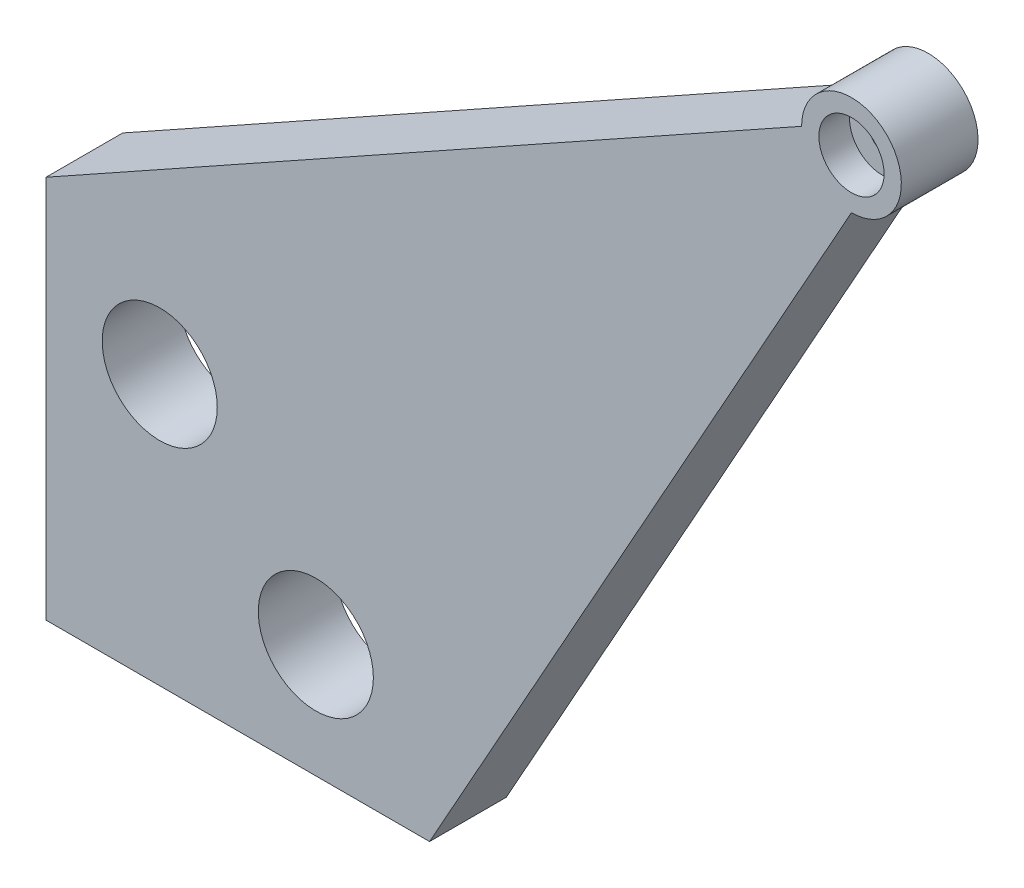
ISO-10303-21;
HEADER;
FILE_DESCRIPTION(('STEP AP214'),'2;1');
FILE_NAME('part.step','',(''),(''),'','','');
FILE_SCHEMA(('AUTOMOTIVE_DESIGN { 1 0 10303 214 1 1 1 1 }'));
ENDSEC;
DATA;
#1=APPLICATION_CONTEXT('core data for automotive mechanical design processes');
#2=APPLICATION_PROTOCOL_DEFINITION('international standard','automotive_design',2000,#1);
#3=PRODUCT_CONTEXT('',#1,'mechanical');
#4=PRODUCT('Part','Part','',(#3));
#5=PRODUCT_RELATED_PRODUCT_CATEGORY('part','',(#4));
#6=PRODUCT_DEFINITION_FORMATION('','',#4);
#7=PRODUCT_DEFINITION_CONTEXT('part definition',#1,'design');
#8=PRODUCT_DEFINITION('design','',#6,#7);
#9=PRODUCT_DEFINITION_SHAPE('','',#8);
#10=(LENGTH_UNIT() NAMED_UNIT(*) SI_UNIT(.MILLI.,.METRE.));
#11=(NAMED_UNIT(*) PLANE_ANGLE_UNIT() SI_UNIT($,.RADIAN.));
#12=(NAMED_UNIT(*) SI_UNIT($,.STERADIAN.) SOLID_ANGLE_UNIT());
#13=UNCERTAINTY_MEASURE_WITH_UNIT(LENGTH_MEASURE(1.E-05),#10,'distance_accuracy_value','');
#14=(GEOMETRIC_REPRESENTATION_CONTEXT(3) GLOBAL_UNCERTAINTY_ASSIGNED_CONTEXT((#13)) GLOBAL_UNIT_ASSIGNED_CONTEXT((#10,
#11,#12)) REPRESENTATION_CONTEXT('',''));
#15=CARTESIAN_POINT('',(0.,0.,0.));
#16=DIRECTION('',(0.,0.,1.));
#17=DIRECTION('',(1.,0.,0.));
#18=AXIS2_PLACEMENT_3D('',#15,#16,#17);
#19=CARTESIAN_POINT('',(0.,0.,5.));
#20=DIRECTION('',(1.,0.,0.));
#21=DIRECTION('',(0.,1.,0.));
#22=AXIS2_PLACEMENT_3D('',#19,#20,#21);
#23=PLANE('',#22);
#24=DIRECTION('',(0.,-1.,0.));
#25=VECTOR('',#24,1.);
#26=CARTESIAN_POINT('',(0.,0.,-5.));
#27=LINE('',#26,#25);
#28=CARTESIAN_POINT('',(0.,50.,-5.));
#29=VERTEX_POINT('',#28);
#30=CARTESIAN_POINT('',(0.,0.,-5.));
#31=VERTEX_POINT('',#30);
#32=EDGE_CURVE('E112',#29,#31,#27,.T.);
#33=ORIENTED_EDGE('',*,*,#32,.T.);
#34=DIRECTION('',(0.,0.,-1.));
#35=VECTOR('',#34,1.);
#36=CARTESIAN_POINT('',(0.,0.,5.));
#37=LINE('',#36,#35);
#38=CARTESIAN_POINT('',(0.,0.,5.));
#39=VERTEX_POINT('',#38);
#40=EDGE_CURVE('E11',#39,#31,#37,.T.);
#41=ORIENTED_EDGE('',*,*,#40,.F.);
#42=DIRECTION('',(0.,-1.,0.));
#43=VECTOR('',#42,1.);
#44=CARTESIAN_POINT('',(0.,0.,5.));
#45=LINE('',#44,#43);
#46=CARTESIAN_POINT('',(0.,50.,5.));
#47=VERTEX_POINT('',#46);
#48=EDGE_CURVE('E121',#47,#39,#45,.T.);
#49=ORIENTED_EDGE('',*,*,#48,.F.);
#50=DIRECTION('',(0.,0.,-1.));
#51=VECTOR('',#50,1.);
#52=CARTESIAN_POINT('',(0.,50.,5.));
#53=LINE('',#52,#51);
#54=EDGE_CURVE('E108',#47,#29,#53,.T.);
#55=ORIENTED_EDGE('',*,*,#54,.T.);
#56=EDGE_LOOP('',(#33,#41,#49,#55));
#57=FACE_BOUND('',#56,.T.);
#58=ADVANCED_FACE('F38',(#57),#23,.F.);
#59=CARTESIAN_POINT('',(0.,0.,5.));
#60=DIRECTION('',(0.,1.,0.));
#61=DIRECTION('',(0.,0.,1.));
#62=AXIS2_PLACEMENT_3D('',#59,#60,#61);
#63=PLANE('',#62);
#64=DIRECTION('',(1.,0.,0.));
#65=VECTOR('',#64,1.);
#66=CARTESIAN_POINT('',(0.,0.,-5.));
#67=LINE('',#66,#65);
#68=CARTESIAN_POINT('',(50.,0.,-5.));
#69=VERTEX_POINT('',#68);
#70=EDGE_CURVE('E115',#31,#69,#67,.T.);
#71=ORIENTED_EDGE('',*,*,#70,.T.);
#72=DIRECTION('',(0.,0.,-1.));
#73=VECTOR('',#72,1.);
#74=CARTESIAN_POINT('',(50.,0.,5.));
#75=LINE('',#74,#73);
#76=CARTESIAN_POINT('',(50.,0.,5.));
#77=VERTEX_POINT('',#76);
#78=EDGE_CURVE('E46',#77,#69,#75,.T.);
#79=ORIENTED_EDGE('',*,*,#78,.F.);
#80=DIRECTION('',(1.,0.,0.));
#81=VECTOR('',#80,1.);
#82=CARTESIAN_POINT('',(0.,0.,5.));
#83=LINE('',#82,#81);
#84=EDGE_CURVE('E88',#39,#77,#83,.T.);
#85=ORIENTED_EDGE('',*,*,#84,.F.);
#86=ORIENTED_EDGE('',*,*,#40,.T.);
#87=EDGE_LOOP('',(#71,#79,#85,#86));
#88=FACE_BOUND('',#87,.T.);
#89=ADVANCED_FACE('F141',(#88),#63,.F.);
#90=CARTESIAN_POINT('',(50.,0.,5.));
#91=DIRECTION('',(-0.873109961084313,0.487523328524236,0.));
#92=DIRECTION('',(-0.487523328524236,-0.873109961084313,0.));
#93=AXIS2_PLACEMENT_3D('',#90,#91,#92);
#94=PLANE('',#93);
#95=DIRECTION('',(0.487523328524236,0.873109961084313,0.));
#96=VECTOR('',#95,1.);
#97=CARTESIAN_POINT('',(50.,0.,-5.));
#98=LINE('',#97,#96);
#99=CARTESIAN_POINT('',(105.,98.5,-5.));
#100=VERTEX_POINT('',#99);
#101=EDGE_CURVE('E103',#69,#100,#98,.T.);
#102=ORIENTED_EDGE('',*,*,#101,.T.);
#103=DIRECTION('',(0.,0.,-1.));
#104=VECTOR('',#103,1.);
#105=CARTESIAN_POINT('',(105.,98.5,5.));
#106=LINE('',#105,#104);
#107=CARTESIAN_POINT('',(105.,98.5,5.));
#108=VERTEX_POINT('',#107);
#109=EDGE_CURVE('E100',#108,#100,#106,.T.);
#110=ORIENTED_EDGE('',*,*,#109,.F.);
#111=DIRECTION('',(0.487523328524236,0.873109961084313,0.));
#112=VECTOR('',#111,1.);
#113=CARTESIAN_POINT('',(50.,0.,5.));
#114=LINE('',#113,#112);
#115=EDGE_CURVE('E92',#77,#108,#114,.T.);
#116=ORIENTED_EDGE('',*,*,#115,.F.);
#117=ORIENTED_EDGE('',*,*,#78,.T.);
#118=EDGE_LOOP('',(#102,#110,#116,#117));
#119=FACE_BOUND('',#118,.T.);
#120=ADVANCED_FACE('F101',(#119),#94,.F.);
#121=CARTESIAN_POINT('',(105.,105.,5.));
#122=DIRECTION('',(0.,0.,-1.));
#123=DIRECTION('',(-1.,0.,0.));
#124=AXIS2_PLACEMENT_3D('',#121,#122,#123);
#125=CYLINDRICAL_SURFACE('',#124,6.50000000000001);
#126=CARTESIAN_POINT('',(105.,105.,-5.));
#127=DIRECTION('',(0.,0.,1.));
#128=DIRECTION('',(1.,0.,0.));
#129=AXIS2_PLACEMENT_3D('',#126,#127,#128);
#130=CIRCLE('',#129,6.50000000000001);
#131=CARTESIAN_POINT('',(98.5,105.,-5.));
#132=VERTEX_POINT('',#131);
#133=EDGE_CURVE('E74',#100,#132,#130,.T.);
#134=ORIENTED_EDGE('',*,*,#133,.T.);
#135=DIRECTION('',(0.,0.,-1.));
#136=VECTOR('',#135,1.);
#137=CARTESIAN_POINT('',(98.5,105.,5.));
#138=LINE('',#137,#136);
#139=CARTESIAN_POINT('',(98.5,105.,5.));
#140=VERTEX_POINT('',#139);
#141=EDGE_CURVE('E104',#140,#132,#138,.T.);
#142=ORIENTED_EDGE('',*,*,#141,.F.);
#143=CARTESIAN_POINT('',(105.,105.,5.));
#144=DIRECTION('',(0.,0.,1.));
#145=DIRECTION('',(1.,0.,0.));
#146=AXIS2_PLACEMENT_3D('',#143,#144,#145);
#147=CIRCLE('',#146,6.50000000000001);
#148=EDGE_CURVE('E96',#108,#140,#147,.T.);
#149=ORIENTED_EDGE('',*,*,#148,.F.);
#150=ORIENTED_EDGE('',*,*,#109,.T.);
#151=EDGE_LOOP('',(#134,#142,#149,#150));
#152=FACE_BOUND('',#151,.T.);
#153=ADVANCED_FACE('F106',(#152),#125,.T.);
#154=CARTESIAN_POINT('',(0.,50.,5.));
#155=DIRECTION('',(0.487523328524236,-0.873109961084313,0.));
#156=DIRECTION('',(0.873109961084313,0.487523328524236,0.));
#157=AXIS2_PLACEMENT_3D('',#154,#155,#156);
#158=PLANE('',#157);
#159=DIRECTION('',(-0.873109961084313,-0.487523328524236,0.));
#160=VECTOR('',#159,1.);
#161=CARTESIAN_POINT('',(0.,50.,-5.));
#162=LINE('',#161,#160);
#163=EDGE_CURVE('E80',#132,#29,#162,.T.);
#164=ORIENTED_EDGE('',*,*,#163,.T.);
#165=ORIENTED_EDGE('',*,*,#54,.F.);
#166=DIRECTION('',(-0.873109961084313,-0.487523328524236,0.));
#167=VECTOR('',#166,1.);
#168=CARTESIAN_POINT('',(0.,50.,5.));
#169=LINE('',#168,#167);
#170=EDGE_CURVE('E54',#140,#47,#169,.T.);
#171=ORIENTED_EDGE('',*,*,#170,.F.);
#172=ORIENTED_EDGE('',*,*,#141,.T.);
#173=EDGE_LOOP('',(#164,#165,#171,#172));
#174=FACE_BOUND('',#173,.T.);
#175=ADVANCED_FACE('F129',(#174),#158,.F.);
#176=CARTESIAN_POINT('',(105.,105.,5.));
#177=DIRECTION('',(0.,0.,1.));
#178=DIRECTION('',(1.,0.,0.));
#179=AXIS2_PLACEMENT_3D('',#176,#177,#178);
#180=PLANE('',#179);
#181=CARTESIAN_POINT('',(14.8255588340632,35.1744411659368,5.));
#182=DIRECTION('',(0.,0.,1.));
#183=DIRECTION('',(1.,0.,0.));
#184=AXIS2_PLACEMENT_3D('',#181,#182,#183);
#185=CIRCLE('',#184,7.5);
#186=CARTESIAN_POINT('',(22.3255588340632,35.1744411659368,5.));
#187=VERTEX_POINT('',#186);
#188=EDGE_CURVE('E233',#187,#187,#185,.T.);
#189=ORIENTED_EDGE('',*,*,#188,.F.);
#190=EDGE_LOOP('',(#189));
#191=FACE_BOUND('',#190,.T.);
#192=CARTESIAN_POINT('',(35.1744411659368,14.8255588340632,5.));
#193=DIRECTION('',(0.,0.,1.));
#194=DIRECTION('',(1.,0.,0.));
#195=AXIS2_PLACEMENT_3D('',#192,#193,#194);
#196=CIRCLE('',#195,7.5);
#197=CARTESIAN_POINT('',(42.6744411659368,14.8255588340632,5.));
#198=VERTEX_POINT('',#197);
#199=EDGE_CURVE('E239',#198,#198,#196,.T.);
#200=ORIENTED_EDGE('',*,*,#199,.F.);
#201=EDGE_LOOP('',(#200));
#202=FACE_BOUND('',#201,.T.);
#203=CARTESIAN_POINT('',(105.,105.,5.));
#204=DIRECTION('',(0.,0.,1.));
#205=DIRECTION('',(1.,0.,0.));
#206=AXIS2_PLACEMENT_3D('',#203,#204,#205);
#207=CIRCLE('',#206,4.25000000000001);
#208=CARTESIAN_POINT('',(109.25,105.,5.));
#209=VERTEX_POINT('',#208);
#210=EDGE_CURVE('E247',#209,#209,#207,.T.);
#211=ORIENTED_EDGE('',*,*,#210,.F.);
#212=EDGE_LOOP('',(#211));
#213=FACE_BOUND('',#212,.T.);
#214=ORIENTED_EDGE('',*,*,#48,.T.);
#215=ORIENTED_EDGE('',*,*,#84,.T.);
#216=ORIENTED_EDGE('',*,*,#115,.T.);
#217=ORIENTED_EDGE('',*,*,#148,.T.);
#218=ORIENTED_EDGE('',*,*,#170,.T.);
#219=EDGE_LOOP('',(#214,#215,#216,#217,#218));
#220=FACE_BOUND('',#219,.T.);
#221=ADVANCED_FACE('F94',(#191,#202,#213,#220),#180,.T.);
#222=CARTESIAN_POINT('',(105.,105.,-5.));
#223=DIRECTION('',(0.,0.,1.));
#224=DIRECTION('',(1.,0.,0.));
#225=AXIS2_PLACEMENT_3D('',#222,#223,#224);
#226=PLANE('',#225);
#227=CARTESIAN_POINT('',(14.8255588340632,35.1744411659368,-5.));
#228=DIRECTION('',(0.,0.,1.));
#229=DIRECTION('',(1.,0.,0.));
#230=AXIS2_PLACEMENT_3D('',#227,#228,#229);
#231=CIRCLE('',#230,7.5);
#232=CARTESIAN_POINT('',(22.3255588340632,35.1744411659368,-5.));
#233=VERTEX_POINT('',#232);
#234=EDGE_CURVE('E230',#233,#233,#231,.T.);
#235=ORIENTED_EDGE('',*,*,#234,.T.);
#236=EDGE_LOOP('',(#235));
#237=FACE_BOUND('',#236,.T.);
#238=CARTESIAN_POINT('',(35.1744411659368,14.8255588340632,-5.));
#239=DIRECTION('',(0.,0.,1.));
#240=DIRECTION('',(1.,0.,0.));
#241=AXIS2_PLACEMENT_3D('',#238,#239,#240);
#242=CIRCLE('',#241,7.5);
#243=CARTESIAN_POINT('',(42.6744411659368,14.8255588340632,-5.));
#244=VERTEX_POINT('',#243);
#245=EDGE_CURVE('E234',#244,#244,#242,.T.);
#246=ORIENTED_EDGE('',*,*,#245,.T.);
#247=EDGE_LOOP('',(#246));
#248=FACE_BOUND('',#247,.T.);
#249=CARTESIAN_POINT('',(105.,105.,-5.));
#250=DIRECTION('',(0.,0.,1.));
#251=DIRECTION('',(1.,0.,0.));
#252=AXIS2_PLACEMENT_3D('',#249,#250,#251);
#253=CIRCLE('',#252,1.5);
#254=CARTESIAN_POINT('',(106.5,105.,-5.));
#255=VERTEX_POINT('',#254);
#256=EDGE_CURVE('E244',#255,#255,#253,.T.);
#257=ORIENTED_EDGE('',*,*,#256,.T.);
#258=EDGE_LOOP('',(#257));
#259=FACE_BOUND('',#258,.T.);
#260=ORIENTED_EDGE('',*,*,#32,.F.);
#261=ORIENTED_EDGE('',*,*,#163,.F.);
#262=ORIENTED_EDGE('',*,*,#133,.F.);
#263=ORIENTED_EDGE('',*,*,#101,.F.);
#264=ORIENTED_EDGE('',*,*,#70,.F.);
#265=EDGE_LOOP('',(#260,#261,#262,#263,#264));
#266=FACE_BOUND('',#265,.T.);
#267=ADVANCED_FACE('F125',(#237,#248,#259,#266),#226,.F.);
#268=CARTESIAN_POINT('',(105.,105.,1.));
#269=DIRECTION('',(0.,0.,1.));
#270=DIRECTION('',(1.,0.,0.));
#271=AXIS2_PLACEMENT_3D('',#268,#269,#270);
#272=CYLINDRICAL_SURFACE('',#271,4.25000000000001);
#273=CARTESIAN_POINT('',(105.,105.,1.));
#274=DIRECTION('',(0.,0.,1.));
#275=DIRECTION('',(1.,0.,0.));
#276=AXIS2_PLACEMENT_3D('',#273,#274,#275);
#277=CIRCLE('',#276,4.25000000000001);
#278=CARTESIAN_POINT('',(109.25,105.,1.));
#279=VERTEX_POINT('',#278);
#280=EDGE_CURVE('E116',#279,#279,#277,.T.);
#281=ORIENTED_EDGE('',*,*,#280,.F.);
#282=EDGE_LOOP('',(#281));
#283=FACE_BOUND('',#282,.T.);
#284=ORIENTED_EDGE('',*,*,#210,.T.);
#285=EDGE_LOOP('',(#284));
#286=FACE_BOUND('',#285,.T.);
#287=ADVANCED_FACE('F165',(#283,#286),#272,.F.);
#288=CARTESIAN_POINT('',(105.,105.,1.));
#289=DIRECTION('',(0.,0.,1.));
#290=DIRECTION('',(1.,0.,0.));
#291=AXIS2_PLACEMENT_3D('',#288,#289,#290);
#292=PLANE('',#291);
#293=CARTESIAN_POINT('',(105.,105.,1.));
#294=DIRECTION('',(0.,0.,1.));
#295=DIRECTION('',(1.,0.,0.));
#296=AXIS2_PLACEMENT_3D('',#293,#294,#295);
#297=CIRCLE('',#296,1.5);
#298=CARTESIAN_POINT('',(106.5,105.,1.));
#299=VERTEX_POINT('',#298);
#300=EDGE_CURVE('E236',#299,#299,#297,.T.);
#301=ORIENTED_EDGE('',*,*,#300,.F.);
#302=EDGE_LOOP('',(#301));
#303=FACE_BOUND('',#302,.T.);
#304=ORIENTED_EDGE('',*,*,#280,.T.);
#305=EDGE_LOOP('',(#304));
#306=FACE_BOUND('',#305,.T.);
#307=ADVANCED_FACE('F170',(#303,#306),#292,.T.);
#308=CARTESIAN_POINT('',(105.,105.,-5.));
#309=DIRECTION('',(0.,0.,1.));
#310=DIRECTION('',(1.,0.,0.));
#311=AXIS2_PLACEMENT_3D('',#308,#309,#310);
#312=CYLINDRICAL_SURFACE('',#311,1.5);
#313=ORIENTED_EDGE('',*,*,#256,.F.);
#314=EDGE_LOOP('',(#313));
#315=FACE_BOUND('',#314,.T.);
#316=ORIENTED_EDGE('',*,*,#300,.T.);
#317=EDGE_LOOP('',(#316));
#318=FACE_BOUND('',#317,.T.);
#319=ADVANCED_FACE('F182',(#315,#318),#312,.F.);
#320=CARTESIAN_POINT('',(35.1744411659368,14.8255588340632,-5.));
#321=DIRECTION('',(0.,0.,1.));
#322=DIRECTION('',(1.,0.,0.));
#323=AXIS2_PLACEMENT_3D('',#320,#321,#322);
#324=CYLINDRICAL_SURFACE('',#323,7.5);
#325=ORIENTED_EDGE('',*,*,#245,.F.);
#326=EDGE_LOOP('',(#325));
#327=FACE_BOUND('',#326,.T.);
#328=ORIENTED_EDGE('',*,*,#199,.T.);
#329=EDGE_LOOP('',(#328));
#330=FACE_BOUND('',#329,.T.);
#331=ADVANCED_FACE('F192',(#327,#330),#324,.F.);
#332=CARTESIAN_POINT('',(14.8255588340632,35.1744411659368,-5.));
#333=DIRECTION('',(0.,0.,1.));
#334=DIRECTION('',(1.,0.,0.));
#335=AXIS2_PLACEMENT_3D('',#332,#333,#334);
#336=CYLINDRICAL_SURFACE('',#335,7.5);
#337=ORIENTED_EDGE('',*,*,#234,.F.);
#338=EDGE_LOOP('',(#337));
#339=FACE_BOUND('',#338,.T.);
#340=ORIENTED_EDGE('',*,*,#188,.T.);
#341=EDGE_LOOP('',(#340));
#342=FACE_BOUND('',#341,.T.);
#343=ADVANCED_FACE('F213',(#339,#342),#336,.F.);
#344=CLOSED_SHELL('',(#58,#89,#120,#153,#175,#221,#267,#287,#307,#319,#331,#343));
#345=MANIFOLD_SOLID_BREP('B2',#344);
#346=ADVANCED_BREP_SHAPE_REPRESENTATION('',(#18,#345),#14);
#347=SHAPE_DEFINITION_REPRESENTATION(#9,#346);
ENDSEC;
END-ISO-10303-21;
